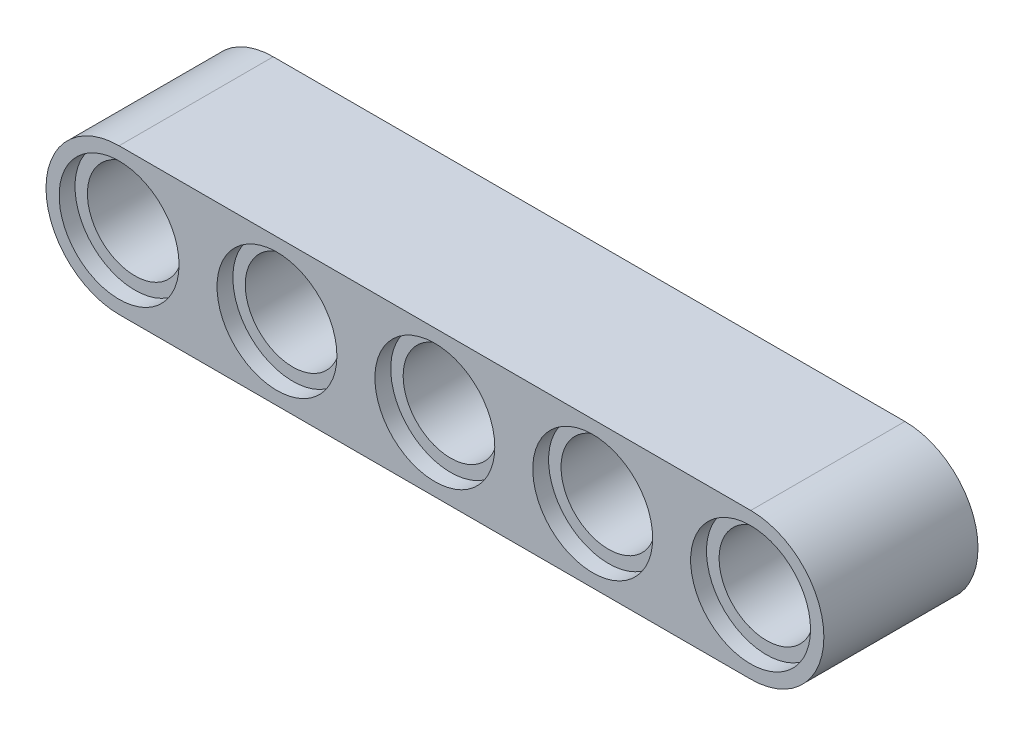
ISO-10303-21;
HEADER;
FILE_DESCRIPTION(('STEP AP214'),'2;1');
FILE_NAME('part.step','',(''),(''),'','','');
FILE_SCHEMA(('AUTOMOTIVE_DESIGN { 1 0 10303 214 1 1 1 1 }'));
ENDSEC;
DATA;
#1=APPLICATION_CONTEXT('core data for automotive mechanical design processes');
#2=APPLICATION_PROTOCOL_DEFINITION('international standard','automotive_design',2000,#1);
#3=PRODUCT_CONTEXT('',#1,'mechanical');
#4=PRODUCT('Part','Part','',(#3));
#5=PRODUCT_RELATED_PRODUCT_CATEGORY('part','',(#4));
#6=PRODUCT_DEFINITION_FORMATION('','',#4);
#7=PRODUCT_DEFINITION_CONTEXT('part definition',#1,'design');
#8=PRODUCT_DEFINITION('design','',#6,#7);
#9=PRODUCT_DEFINITION_SHAPE('','',#8);
#10=(LENGTH_UNIT() NAMED_UNIT(*) SI_UNIT(.MILLI.,.METRE.));
#11=(NAMED_UNIT(*) PLANE_ANGLE_UNIT() SI_UNIT($,.RADIAN.));
#12=(NAMED_UNIT(*) SI_UNIT($,.STERADIAN.) SOLID_ANGLE_UNIT());
#13=UNCERTAINTY_MEASURE_WITH_UNIT(LENGTH_MEASURE(1.E-05),#10,'distance_accuracy_value','');
#14=(GEOMETRIC_REPRESENTATION_CONTEXT(3) GLOBAL_UNCERTAINTY_ASSIGNED_CONTEXT((#13)) GLOBAL_UNIT_ASSIGNED_CONTEXT((#10,
#11,#12)) REPRESENTATION_CONTEXT('',''));
#15=CARTESIAN_POINT('',(0.,0.,0.));
#16=DIRECTION('',(0.,0.,1.));
#17=DIRECTION('',(1.,0.,0.));
#18=AXIS2_PLACEMENT_3D('',#15,#16,#17);
#19=CARTESIAN_POINT('',(-240.6,-24.8965545458983,-0.01));
#20=DIRECTION('',(0.,0.,1.));
#21=DIRECTION('',(1.,0.,0.));
#22=AXIS2_PLACEMENT_3D('',#19,#20,#21);
#23=CYLINDRICAL_SURFACE('',#22,24.);
#24=CARTESIAN_POINT('',(-240.6,-24.8965545458983,69.8));
#25=DIRECTION('',(0.,0.,1.));
#26=DIRECTION('',(1.,0.,0.));
#27=AXIS2_PLACEMENT_3D('',#24,#25,#26);
#28=CIRCLE('',#27,24.);
#29=CARTESIAN_POINT('',(-216.6,-24.8965545458983,69.8));
#30=VERTEX_POINT('',#29);
#31=EDGE_CURVE('E521',#30,#30,#28,.F.);
#32=ORIENTED_EDGE('',*,*,#31,.F.);
#33=EDGE_LOOP('',(#32));
#34=FACE_BOUND('',#33,.T.);
#35=CARTESIAN_POINT('',(-240.6,-24.8965545458983,7.99));
#36=DIRECTION('',(0.,0.,-1.));
#37=DIRECTION('',(-1.,0.,0.));
#38=AXIS2_PLACEMENT_3D('',#35,#36,#37);
#39=CIRCLE('',#38,24.);
#40=CARTESIAN_POINT('',(-264.6,-24.8965545458983,7.99));
#41=VERTEX_POINT('',#40);
#42=EDGE_CURVE('E463',#41,#41,#39,.F.);
#43=ORIENTED_EDGE('',*,*,#42,.F.);
#44=EDGE_LOOP('',(#43));
#45=FACE_BOUND('',#44,.T.);
#46=ADVANCED_FACE('F459',(#34,#45),#23,.F.);
#47=CARTESIAN_POINT('',(78.3,-24.8965545458983,77.8));
#48=DIRECTION('',(0.,0.,-1.));
#49=DIRECTION('',(-1.,0.,0.));
#50=AXIS2_PLACEMENT_3D('',#47,#48,#49);
#51=CYLINDRICAL_SURFACE('',#50,24.);
#52=CARTESIAN_POINT('',(78.3,-24.8965545458983,69.8));
#53=DIRECTION('',(0.,0.,1.));
#54=DIRECTION('',(1.,0.,0.));
#55=AXIS2_PLACEMENT_3D('',#52,#53,#54);
#56=CIRCLE('',#55,24.);
#57=CARTESIAN_POINT('',(102.3,-24.8965545458983,69.8));
#58=VERTEX_POINT('',#57);
#59=EDGE_CURVE('E524',#58,#58,#56,.T.);
#60=ORIENTED_EDGE('',*,*,#59,.T.);
#61=EDGE_LOOP('',(#60));
#62=FACE_BOUND('',#61,.T.);
#63=CARTESIAN_POINT('',(78.3,-24.8965545458983,7.99));
#64=DIRECTION('',(0.,0.,-1.));
#65=DIRECTION('',(-1.,0.,0.));
#66=AXIS2_PLACEMENT_3D('',#63,#64,#65);
#67=CIRCLE('',#66,24.);
#68=CARTESIAN_POINT('',(54.3,-24.8965545458983,7.99));
#69=VERTEX_POINT('',#68);
#70=EDGE_CURVE('E561',#69,#69,#67,.T.);
#71=ORIENTED_EDGE('',*,*,#70,.T.);
#72=EDGE_LOOP('',(#71));
#73=FACE_BOUND('',#72,.T.);
#74=ADVANCED_FACE('F663',(#62,#73),#51,.F.);
#75=CARTESIAN_POINT('',(-1.50000000000003,-24.8965545458983,77.8));
#76=DIRECTION('',(0.,0.,-1.));
#77=DIRECTION('',(-1.,0.,0.));
#78=AXIS2_PLACEMENT_3D('',#75,#76,#77);
#79=CYLINDRICAL_SURFACE('',#78,24.);
#80=CARTESIAN_POINT('',(-1.50000000000003,-24.8965545458983,69.8));
#81=DIRECTION('',(0.,0.,1.));
#82=DIRECTION('',(1.,0.,0.));
#83=AXIS2_PLACEMENT_3D('',#80,#81,#82);
#84=CIRCLE('',#83,24.);
#85=CARTESIAN_POINT('',(22.5,-24.8965545458983,69.8));
#86=VERTEX_POINT('',#85);
#87=EDGE_CURVE('E547',#86,#86,#84,.T.);
#88=ORIENTED_EDGE('',*,*,#87,.T.);
#89=EDGE_LOOP('',(#88));
#90=FACE_BOUND('',#89,.T.);
#91=CARTESIAN_POINT('',(-1.50000000000003,-24.8965545458983,7.99));
#92=DIRECTION('',(0.,0.,-1.));
#93=DIRECTION('',(-1.,0.,0.));
#94=AXIS2_PLACEMENT_3D('',#91,#92,#93);
#95=CIRCLE('',#94,24.);
#96=CARTESIAN_POINT('',(-25.5,-24.8965545458983,7.99));
#97=VERTEX_POINT('',#96);
#98=EDGE_CURVE('E559',#97,#97,#95,.T.);
#99=ORIENTED_EDGE('',*,*,#98,.T.);
#100=EDGE_LOOP('',(#99));
#101=FACE_BOUND('',#100,.T.);
#102=ADVANCED_FACE('F669',(#90,#101),#79,.F.);
#103=CARTESIAN_POINT('',(-81.2,-24.8965545458983,77.8));
#104=DIRECTION('',(0.,0.,-1.));
#105=DIRECTION('',(-1.,0.,0.));
#106=AXIS2_PLACEMENT_3D('',#103,#104,#105);
#107=CYLINDRICAL_SURFACE('',#106,24.);
#108=CARTESIAN_POINT('',(-81.2,-24.8965545458983,69.8));
#109=DIRECTION('',(0.,0.,1.));
#110=DIRECTION('',(1.,0.,0.));
#111=AXIS2_PLACEMENT_3D('',#108,#109,#110);
#112=CIRCLE('',#111,24.);
#113=CARTESIAN_POINT('',(-57.2,-24.8965545458983,69.8));
#114=VERTEX_POINT('',#113);
#115=EDGE_CURVE('E543',#114,#114,#112,.T.);
#116=ORIENTED_EDGE('',*,*,#115,.T.);
#117=EDGE_LOOP('',(#116));
#118=FACE_BOUND('',#117,.T.);
#119=CARTESIAN_POINT('',(-81.2,-24.8965545458983,7.99));
#120=DIRECTION('',(0.,0.,-1.));
#121=DIRECTION('',(-1.,0.,0.));
#122=AXIS2_PLACEMENT_3D('',#119,#120,#121);
#123=CIRCLE('',#122,24.);
#124=CARTESIAN_POINT('',(-105.2,-24.8965545458983,7.99));
#125=VERTEX_POINT('',#124);
#126=EDGE_CURVE('E555',#125,#125,#123,.T.);
#127=ORIENTED_EDGE('',*,*,#126,.T.);
#128=EDGE_LOOP('',(#127));
#129=FACE_BOUND('',#128,.T.);
#130=ADVANCED_FACE('F679',(#118,#129),#107,.F.);
#131=CARTESIAN_POINT('',(-160.9,-24.8965545458983,77.8));
#132=DIRECTION('',(0.,0.,-1.));
#133=DIRECTION('',(-1.,0.,0.));
#134=AXIS2_PLACEMENT_3D('',#131,#132,#133);
#135=CYLINDRICAL_SURFACE('',#134,24.);
#136=CARTESIAN_POINT('',(-160.9,-24.8965545458983,69.8));
#137=DIRECTION('',(0.,0.,1.));
#138=DIRECTION('',(1.,0.,0.));
#139=AXIS2_PLACEMENT_3D('',#136,#137,#138);
#140=CIRCLE('',#139,24.);
#141=CARTESIAN_POINT('',(-136.9,-24.8965545458983,69.8));
#142=VERTEX_POINT('',#141);
#143=EDGE_CURVE('E540',#142,#142,#140,.T.);
#144=ORIENTED_EDGE('',*,*,#143,.T.);
#145=EDGE_LOOP('',(#144));
#146=FACE_BOUND('',#145,.T.);
#147=CARTESIAN_POINT('',(-160.9,-24.8965545458983,7.99));
#148=DIRECTION('',(0.,0.,-1.));
#149=DIRECTION('',(-1.,0.,0.));
#150=AXIS2_PLACEMENT_3D('',#147,#148,#149);
#151=CIRCLE('',#150,24.);
#152=CARTESIAN_POINT('',(-184.9,-24.8965545458983,7.99));
#153=VERTEX_POINT('',#152);
#154=EDGE_CURVE('E552',#153,#153,#151,.T.);
#155=ORIENTED_EDGE('',*,*,#154,.T.);
#156=EDGE_LOOP('',(#155));
#157=FACE_BOUND('',#156,.T.);
#158=ADVANCED_FACE('F683',(#146,#157),#135,.F.);
#159=CARTESIAN_POINT('',(-240.6,-24.8965545458983,77.8));
#160=DIRECTION('',(0.,0.,1.));
#161=DIRECTION('',(1.,0.,0.));
#162=AXIS2_PLACEMENT_3D('',#159,#160,#161);
#163=PLANE('',#162);
#164=CARTESIAN_POINT('',(-240.6,-24.8965545458983,77.8));
#165=DIRECTION('',(0.,0.,1.));
#166=DIRECTION('',(1.,0.,0.));
#167=AXIS2_PLACEMENT_3D('',#164,#165,#166);
#168=CIRCLE('',#167,30.2630714703831);
#169=CARTESIAN_POINT('',(-210.336928529617,-24.8965545458983,77.8));
#170=VERTEX_POINT('',#169);
#171=EDGE_CURVE('E594',#170,#170,#168,.T.);
#172=ORIENTED_EDGE('',*,*,#171,.F.);
#173=EDGE_LOOP('',(#172));
#174=FACE_BOUND('',#173,.T.);
#175=CARTESIAN_POINT('',(-160.9,-24.8965545458983,77.8));
#176=DIRECTION('',(0.,0.,1.));
#177=DIRECTION('',(1.,0.,0.));
#178=AXIS2_PLACEMENT_3D('',#175,#176,#177);
#179=CIRCLE('',#178,30.2630714703831);
#180=CARTESIAN_POINT('',(-130.636928529617,-24.8965545458983,77.8));
#181=VERTEX_POINT('',#180);
#182=EDGE_CURVE('E591',#181,#181,#179,.T.);
#183=ORIENTED_EDGE('',*,*,#182,.F.);
#184=EDGE_LOOP('',(#183));
#185=FACE_BOUND('',#184,.T.);
#186=CARTESIAN_POINT('',(-81.2,-24.8965545458983,77.8));
#187=DIRECTION('',(0.,0.,1.));
#188=DIRECTION('',(1.,0.,0.));
#189=AXIS2_PLACEMENT_3D('',#186,#187,#188);
#190=CIRCLE('',#189,30.2630714703831);
#191=CARTESIAN_POINT('',(-50.9369285296169,-24.8965545458983,77.8));
#192=VERTEX_POINT('',#191);
#193=EDGE_CURVE('E585',#192,#192,#190,.T.);
#194=ORIENTED_EDGE('',*,*,#193,.F.);
#195=EDGE_LOOP('',(#194));
#196=FACE_BOUND('',#195,.T.);
#197=CARTESIAN_POINT('',(-1.50000000000003,-24.8965545458983,77.8));
#198=DIRECTION('',(0.,0.,1.));
#199=DIRECTION('',(1.,0.,0.));
#200=AXIS2_PLACEMENT_3D('',#197,#198,#199);
#201=CIRCLE('',#200,30.2630714703831);
#202=CARTESIAN_POINT('',(28.7630714703831,-24.8965545458983,77.8));
#203=VERTEX_POINT('',#202);
#204=EDGE_CURVE('E577',#203,#203,#201,.T.);
#205=ORIENTED_EDGE('',*,*,#204,.F.);
#206=EDGE_LOOP('',(#205));
#207=FACE_BOUND('',#206,.T.);
#208=CARTESIAN_POINT('',(78.2,-24.8965545458983,77.8));
#209=DIRECTION('',(0.,0.,1.));
#210=DIRECTION('',(1.,0.,0.));
#211=AXIS2_PLACEMENT_3D('',#208,#209,#210);
#212=CIRCLE('',#211,30.2630714703831);
#213=CARTESIAN_POINT('',(108.463071470383,-24.8965545458983,77.8));
#214=VERTEX_POINT('',#213);
#215=EDGE_CURVE('E569',#214,#214,#212,.T.);
#216=ORIENTED_EDGE('',*,*,#215,.F.);
#217=EDGE_LOOP('',(#216));
#218=FACE_BOUND('',#217,.T.);
#219=DIRECTION('',(1.,0.,0.));
#220=VECTOR('',#219,1.);
#221=CARTESIAN_POINT('',(0.,-61.7965545458983,77.8));
#222=LINE('',#221,#220);
#223=CARTESIAN_POINT('',(-240.6,-61.7965545458983,77.8));
#224=VERTEX_POINT('',#223);
#225=CARTESIAN_POINT('',(78.3,-61.7965545458983,77.8));
#226=VERTEX_POINT('',#225);
#227=EDGE_CURVE('E501',#224,#226,#222,.T.);
#228=ORIENTED_EDGE('',*,*,#227,.T.);
#229=CARTESIAN_POINT('',(78.3,-24.8965545458983,77.8));
#230=DIRECTION('',(0.,0.,1.));
#231=DIRECTION('',(1.,0.,0.));
#232=AXIS2_PLACEMENT_3D('',#229,#230,#231);
#233=CIRCLE('',#232,36.9);
#234=CARTESIAN_POINT('',(78.3,12.0034454541017,77.8));
#235=VERTEX_POINT('',#234);
#236=EDGE_CURVE('E510',#226,#235,#233,.T.);
#237=ORIENTED_EDGE('',*,*,#236,.T.);
#238=DIRECTION('',(1.,0.,0.));
#239=VECTOR('',#238,1.);
#240=CARTESIAN_POINT('',(0.,12.0034454541017,77.8));
#241=LINE('',#240,#239);
#242=CARTESIAN_POINT('',(-240.6,12.0034454541017,77.8));
#243=VERTEX_POINT('',#242);
#244=EDGE_CURVE('E516',#243,#235,#241,.T.);
#245=ORIENTED_EDGE('',*,*,#244,.F.);
#246=CARTESIAN_POINT('',(-240.6,-24.8965545458983,77.8));
#247=DIRECTION('',(0.,0.,1.));
#248=DIRECTION('',(1.,0.,0.));
#249=AXIS2_PLACEMENT_3D('',#246,#247,#248);
#250=CIRCLE('',#249,36.9);
#251=EDGE_CURVE('E520',#243,#224,#250,.T.);
#252=ORIENTED_EDGE('',*,*,#251,.T.);
#253=EDGE_LOOP('',(#228,#237,#245,#252));
#254=FACE_BOUND('',#253,.T.);
#255=ADVANCED_FACE('F519',(#174,#185,#196,#207,#218,#254),#163,.T.);
#256=CARTESIAN_POINT('',(-240.6,-24.8965545458983,-0.01));
#257=DIRECTION('',(0.,0.,1.));
#258=DIRECTION('',(1.,0.,0.));
#259=AXIS2_PLACEMENT_3D('',#256,#257,#258);
#260=PLANE('',#259);
#261=CARTESIAN_POINT('',(78.3,-24.8965545458983,-0.01));
#262=DIRECTION('',(0.,0.,-1.));
#263=DIRECTION('',(-1.,0.,0.));
#264=AXIS2_PLACEMENT_3D('',#261,#262,#263);
#265=CIRCLE('',#264,30.265);
#266=CARTESIAN_POINT('',(48.035,-24.8965545458983,-0.01));
#267=VERTEX_POINT('',#266);
#268=EDGE_CURVE('E623',#267,#267,#265,.T.);
#269=ORIENTED_EDGE('',*,*,#268,.F.);
#270=EDGE_LOOP('',(#269));
#271=FACE_BOUND('',#270,.T.);
#272=CARTESIAN_POINT('',(-1.39999999999998,-24.8965545458983,-0.01));
#273=DIRECTION('',(0.,0.,-1.));
#274=DIRECTION('',(-1.,0.,0.));
#275=AXIS2_PLACEMENT_3D('',#272,#273,#274);
#276=CIRCLE('',#275,30.265);
#277=CARTESIAN_POINT('',(-31.665,-24.8965545458983,-0.01));
#278=VERTEX_POINT('',#277);
#279=EDGE_CURVE('E620',#278,#278,#276,.T.);
#280=ORIENTED_EDGE('',*,*,#279,.F.);
#281=EDGE_LOOP('',(#280));
#282=FACE_BOUND('',#281,.T.);
#283=CARTESIAN_POINT('',(-81.1,-24.8965545458983,-0.01));
#284=DIRECTION('',(0.,0.,-1.));
#285=DIRECTION('',(-1.,0.,0.));
#286=AXIS2_PLACEMENT_3D('',#283,#284,#285);
#287=CIRCLE('',#286,30.265);
#288=CARTESIAN_POINT('',(-111.365,-24.8965545458983,-0.01));
#289=VERTEX_POINT('',#288);
#290=EDGE_CURVE('E614',#289,#289,#287,.T.);
#291=ORIENTED_EDGE('',*,*,#290,.F.);
#292=EDGE_LOOP('',(#291));
#293=FACE_BOUND('',#292,.T.);
#294=CARTESIAN_POINT('',(-160.8,-24.8965545458983,-0.01));
#295=DIRECTION('',(0.,0.,-1.));
#296=DIRECTION('',(-1.,0.,0.));
#297=AXIS2_PLACEMENT_3D('',#294,#295,#296);
#298=CIRCLE('',#297,30.265);
#299=CARTESIAN_POINT('',(-191.065,-24.8965545458983,-0.01));
#300=VERTEX_POINT('',#299);
#301=EDGE_CURVE('E608',#300,#300,#298,.T.);
#302=ORIENTED_EDGE('',*,*,#301,.F.);
#303=EDGE_LOOP('',(#302));
#304=FACE_BOUND('',#303,.T.);
#305=CARTESIAN_POINT('',(-240.5,-24.8965545458983,-0.01));
#306=DIRECTION('',(0.,0.,-1.));
#307=DIRECTION('',(-1.,0.,0.));
#308=AXIS2_PLACEMENT_3D('',#305,#306,#307);
#309=CIRCLE('',#308,30.265);
#310=CARTESIAN_POINT('',(-270.765,-24.8965545458983,-0.01));
#311=VERTEX_POINT('',#310);
#312=EDGE_CURVE('E602',#311,#311,#309,.T.);
#313=ORIENTED_EDGE('',*,*,#312,.F.);
#314=EDGE_LOOP('',(#313));
#315=FACE_BOUND('',#314,.T.);
#316=DIRECTION('',(1.,0.,0.));
#317=VECTOR('',#316,1.);
#318=CARTESIAN_POINT('',(0.,-61.7965545458983,-0.01));
#319=LINE('',#318,#317);
#320=CARTESIAN_POINT('',(-240.6,-61.7965545458983,-0.01));
#321=VERTEX_POINT('',#320);
#322=CARTESIAN_POINT('',(78.3,-61.7965545458983,-0.01));
#323=VERTEX_POINT('',#322);
#324=EDGE_CURVE('E502',#321,#323,#319,.T.);
#325=ORIENTED_EDGE('',*,*,#324,.F.);
#326=CARTESIAN_POINT('',(-240.6,-24.8965545458983,-0.01));
#327=DIRECTION('',(0.,0.,1.));
#328=DIRECTION('',(1.,0.,0.));
#329=AXIS2_PLACEMENT_3D('',#326,#327,#328);
#330=CIRCLE('',#329,36.9);
#331=CARTESIAN_POINT('',(-240.6,12.0034454541017,-0.01));
#332=VERTEX_POINT('',#331);
#333=EDGE_CURVE('E507',#332,#321,#330,.T.);
#334=ORIENTED_EDGE('',*,*,#333,.F.);
#335=DIRECTION('',(1.,0.,0.));
#336=VECTOR('',#335,1.);
#337=CARTESIAN_POINT('',(0.,12.0034454541017,-0.01));
#338=LINE('',#337,#336);
#339=CARTESIAN_POINT('',(78.3,12.0034454541017,-0.01));
#340=VERTEX_POINT('',#339);
#341=EDGE_CURVE('E535',#332,#340,#338,.T.);
#342=ORIENTED_EDGE('',*,*,#341,.T.);
#343=CARTESIAN_POINT('',(78.3,-24.8965545458983,-0.01));
#344=DIRECTION('',(0.,0.,1.));
#345=DIRECTION('',(1.,0.,0.));
#346=AXIS2_PLACEMENT_3D('',#343,#344,#345);
#347=CIRCLE('',#346,36.9);
#348=EDGE_CURVE('E533',#323,#340,#347,.T.);
#349=ORIENTED_EDGE('',*,*,#348,.F.);
#350=EDGE_LOOP('',(#325,#334,#342,#349));
#351=FACE_BOUND('',#350,.T.);
#352=ADVANCED_FACE('F638',(#271,#282,#293,#304,#315,#351),#260,.F.);
#353=CARTESIAN_POINT('',(-240.6,-24.8965545458983,-0.01));
#354=DIRECTION('',(0.,0.,1.));
#355=DIRECTION('',(1.,0.,0.));
#356=AXIS2_PLACEMENT_3D('',#353,#354,#355);
#357=CYLINDRICAL_SURFACE('',#356,36.9);
#358=DIRECTION('',(0.,0.,1.));
#359=VECTOR('',#358,1.);
#360=CARTESIAN_POINT('',(-240.6,-61.7965545458983,-0.01));
#361=LINE('',#360,#359);
#362=EDGE_CURVE('E12',#321,#224,#361,.T.);
#363=ORIENTED_EDGE('',*,*,#362,.T.);
#364=ORIENTED_EDGE('',*,*,#251,.F.);
#365=DIRECTION('',(0.,0.,1.));
#366=VECTOR('',#365,1.);
#367=CARTESIAN_POINT('',(-240.6,12.0034454541017,-0.01));
#368=LINE('',#367,#366);
#369=EDGE_CURVE('E468',#332,#243,#368,.T.);
#370=ORIENTED_EDGE('',*,*,#369,.F.);
#371=ORIENTED_EDGE('',*,*,#333,.T.);
#372=EDGE_LOOP('',(#363,#364,#370,#371));
#373=FACE_BOUND('',#372,.T.);
#374=ADVANCED_FACE('F641',(#373),#357,.T.);
#375=CARTESIAN_POINT('',(0.,12.0034454541017,-0.01));
#376=DIRECTION('',(0.,-1.,0.));
#377=DIRECTION('',(0.,0.,-1.));
#378=AXIS2_PLACEMENT_3D('',#375,#376,#377);
#379=PLANE('',#378);
#380=ORIENTED_EDGE('',*,*,#369,.T.);
#381=ORIENTED_EDGE('',*,*,#244,.T.);
#382=DIRECTION('',(0.,0.,1.));
#383=VECTOR('',#382,1.);
#384=CARTESIAN_POINT('',(78.3,12.0034454541017,-0.01));
#385=LINE('',#384,#383);
#386=EDGE_CURVE('E506',#340,#235,#385,.T.);
#387=ORIENTED_EDGE('',*,*,#386,.F.);
#388=ORIENTED_EDGE('',*,*,#341,.F.);
#389=EDGE_LOOP('',(#380,#381,#387,#388));
#390=FACE_BOUND('',#389,.T.);
#391=ADVANCED_FACE('F653',(#390),#379,.F.);
#392=CARTESIAN_POINT('',(78.3,-24.8965545458983,-0.01));
#393=DIRECTION('',(0.,0.,1.));
#394=DIRECTION('',(1.,0.,0.));
#395=AXIS2_PLACEMENT_3D('',#392,#393,#394);
#396=CYLINDRICAL_SURFACE('',#395,36.9);
#397=ORIENTED_EDGE('',*,*,#386,.T.);
#398=ORIENTED_EDGE('',*,*,#236,.F.);
#399=DIRECTION('',(0.,0.,1.));
#400=VECTOR('',#399,1.);
#401=CARTESIAN_POINT('',(78.3,-61.7965545458983,-0.01));
#402=LINE('',#401,#400);
#403=EDGE_CURVE('E498',#323,#226,#402,.T.);
#404=ORIENTED_EDGE('',*,*,#403,.F.);
#405=ORIENTED_EDGE('',*,*,#348,.T.);
#406=EDGE_LOOP('',(#397,#398,#404,#405));
#407=FACE_BOUND('',#406,.T.);
#408=ADVANCED_FACE('F511',(#407),#396,.T.);
#409=CARTESIAN_POINT('',(0.,-61.7965545458983,-0.01));
#410=DIRECTION('',(0.,-1.,0.));
#411=DIRECTION('',(0.,0.,-1.));
#412=AXIS2_PLACEMENT_3D('',#409,#410,#411);
#413=PLANE('',#412);
#414=ORIENTED_EDGE('',*,*,#403,.T.);
#415=ORIENTED_EDGE('',*,*,#227,.F.);
#416=ORIENTED_EDGE('',*,*,#362,.F.);
#417=ORIENTED_EDGE('',*,*,#324,.T.);
#418=EDGE_LOOP('',(#414,#415,#416,#417));
#419=FACE_BOUND('',#418,.T.);
#420=ADVANCED_FACE('F461',(#419),#413,.T.);
#421=CARTESIAN_POINT('',(-160.9,-24.8965545458983,69.8));
#422=DIRECTION('',(0.,0.,1.));
#423=DIRECTION('',(1.,0.,0.));
#424=AXIS2_PLACEMENT_3D('',#421,#422,#423);
#425=CYLINDRICAL_SURFACE('',#424,30.2630714703831);
#426=CARTESIAN_POINT('',(-160.9,-24.8965545458983,69.8));
#427=DIRECTION('',(0.,0.,1.));
#428=DIRECTION('',(1.,0.,0.));
#429=AXIS2_PLACEMENT_3D('',#426,#427,#428);
#430=CIRCLE('',#429,30.2630714703831);
#431=CARTESIAN_POINT('',(-130.636928529617,-24.8965545458983,69.8));
#432=VERTEX_POINT('',#431);
#433=EDGE_CURVE('E588',#432,#432,#430,.T.);
#434=ORIENTED_EDGE('',*,*,#433,.F.);
#435=EDGE_LOOP('',(#434));
#436=FACE_BOUND('',#435,.T.);
#437=ORIENTED_EDGE('',*,*,#182,.T.);
#438=EDGE_LOOP('',(#437));
#439=FACE_BOUND('',#438,.T.);
#440=ADVANCED_FACE('F660',(#436,#439),#425,.F.);
#441=CARTESIAN_POINT('',(-160.9,-24.8965545458983,69.8));
#442=DIRECTION('',(0.,0.,1.));
#443=DIRECTION('',(1.,0.,0.));
#444=AXIS2_PLACEMENT_3D('',#441,#442,#443);
#445=PLANE('',#444);
#446=ORIENTED_EDGE('',*,*,#143,.F.);
#447=EDGE_LOOP('',(#446));
#448=FACE_BOUND('',#447,.T.);
#449=ORIENTED_EDGE('',*,*,#433,.T.);
#450=EDGE_LOOP('',(#449));
#451=FACE_BOUND('',#450,.T.);
#452=ADVANCED_FACE('F731',(#448,#451),#445,.T.);
#453=CARTESIAN_POINT('',(-81.2,-24.8965545458983,69.8));
#454=DIRECTION('',(0.,0.,1.));
#455=DIRECTION('',(1.,0.,0.));
#456=AXIS2_PLACEMENT_3D('',#453,#454,#455);
#457=CYLINDRICAL_SURFACE('',#456,30.2630714703831);
#458=CARTESIAN_POINT('',(-81.2,-24.8965545458983,69.8));
#459=DIRECTION('',(0.,0.,1.));
#460=DIRECTION('',(1.,0.,0.));
#461=AXIS2_PLACEMENT_3D('',#458,#459,#460);
#462=CIRCLE('',#461,30.2630714703831);
#463=CARTESIAN_POINT('',(-50.9369285296169,-24.8965545458983,69.8));
#464=VERTEX_POINT('',#463);
#465=EDGE_CURVE('E582',#464,#464,#462,.T.);
#466=ORIENTED_EDGE('',*,*,#465,.F.);
#467=EDGE_LOOP('',(#466));
#468=FACE_BOUND('',#467,.T.);
#469=ORIENTED_EDGE('',*,*,#193,.T.);
#470=EDGE_LOOP('',(#469));
#471=FACE_BOUND('',#470,.T.);
#472=ADVANCED_FACE('F735',(#468,#471),#457,.F.);
#473=CARTESIAN_POINT('',(-81.2,-24.8965545458983,69.8));
#474=DIRECTION('',(0.,0.,1.));
#475=DIRECTION('',(1.,0.,0.));
#476=AXIS2_PLACEMENT_3D('',#473,#474,#475);
#477=PLANE('',#476);
#478=ORIENTED_EDGE('',*,*,#115,.F.);
#479=EDGE_LOOP('',(#478));
#480=FACE_BOUND('',#479,.T.);
#481=ORIENTED_EDGE('',*,*,#465,.T.);
#482=EDGE_LOOP('',(#481));
#483=FACE_BOUND('',#482,.T.);
#484=ADVANCED_FACE('F739',(#480,#483),#477,.T.);
#485=CARTESIAN_POINT('',(-1.50000000000003,-24.8965545458983,69.8));
#486=DIRECTION('',(0.,0.,1.));
#487=DIRECTION('',(1.,0.,0.));
#488=AXIS2_PLACEMENT_3D('',#485,#486,#487);
#489=CYLINDRICAL_SURFACE('',#488,30.2630714703831);
#490=CARTESIAN_POINT('',(-1.50000000000003,-24.8965545458983,69.8));
#491=DIRECTION('',(0.,0.,1.));
#492=DIRECTION('',(1.,0.,0.));
#493=AXIS2_PLACEMENT_3D('',#490,#491,#492);
#494=CIRCLE('',#493,30.2630714703831);
#495=CARTESIAN_POINT('',(28.7630714703831,-24.8965545458983,69.8));
#496=VERTEX_POINT('',#495);
#497=EDGE_CURVE('E573',#496,#496,#494,.T.);
#498=ORIENTED_EDGE('',*,*,#497,.F.);
#499=EDGE_LOOP('',(#498));
#500=FACE_BOUND('',#499,.T.);
#501=ORIENTED_EDGE('',*,*,#204,.T.);
#502=EDGE_LOOP('',(#501));
#503=FACE_BOUND('',#502,.T.);
#504=ADVANCED_FACE('F743',(#500,#503),#489,.F.);
#505=CARTESIAN_POINT('',(-1.50000000000003,-24.8965545458983,69.8));
#506=DIRECTION('',(0.,0.,1.));
#507=DIRECTION('',(1.,0.,0.));
#508=AXIS2_PLACEMENT_3D('',#505,#506,#507);
#509=PLANE('',#508);
#510=ORIENTED_EDGE('',*,*,#87,.F.);
#511=EDGE_LOOP('',(#510));
#512=FACE_BOUND('',#511,.T.);
#513=ORIENTED_EDGE('',*,*,#497,.T.);
#514=EDGE_LOOP('',(#513));
#515=FACE_BOUND('',#514,.T.);
#516=ADVANCED_FACE('F747',(#512,#515),#509,.T.);
#517=CARTESIAN_POINT('',(78.2,-24.8965545458983,69.8));
#518=DIRECTION('',(0.,0.,1.));
#519=DIRECTION('',(1.,0.,0.));
#520=AXIS2_PLACEMENT_3D('',#517,#518,#519);
#521=CYLINDRICAL_SURFACE('',#520,30.2630714703831);
#522=CARTESIAN_POINT('',(78.2,-24.8965545458983,69.8));
#523=DIRECTION('',(0.,0.,1.));
#524=DIRECTION('',(1.,0.,0.));
#525=AXIS2_PLACEMENT_3D('',#522,#523,#524);
#526=CIRCLE('',#525,30.2630714703831);
#527=CARTESIAN_POINT('',(108.463071470383,-24.8965545458983,69.8));
#528=VERTEX_POINT('',#527);
#529=EDGE_CURVE('E527',#528,#528,#526,.T.);
#530=ORIENTED_EDGE('',*,*,#529,.F.);
#531=EDGE_LOOP('',(#530));
#532=FACE_BOUND('',#531,.T.);
#533=ORIENTED_EDGE('',*,*,#215,.T.);
#534=EDGE_LOOP('',(#533));
#535=FACE_BOUND('',#534,.T.);
#536=ADVANCED_FACE('F751',(#532,#535),#521,.F.);
#537=CARTESIAN_POINT('',(78.2,-24.8965545458983,69.8));
#538=DIRECTION('',(0.,0.,1.));
#539=DIRECTION('',(1.,0.,0.));
#540=AXIS2_PLACEMENT_3D('',#537,#538,#539);
#541=PLANE('',#540);
#542=ORIENTED_EDGE('',*,*,#59,.F.);
#543=EDGE_LOOP('',(#542));
#544=FACE_BOUND('',#543,.T.);
#545=ORIENTED_EDGE('',*,*,#529,.T.);
#546=EDGE_LOOP('',(#545));
#547=FACE_BOUND('',#546,.T.);
#548=ADVANCED_FACE('F724',(#544,#547),#541,.T.);
#549=CARTESIAN_POINT('',(-240.6,-24.8965545458983,69.8));
#550=DIRECTION('',(0.,0.,1.));
#551=DIRECTION('',(1.,0.,0.));
#552=AXIS2_PLACEMENT_3D('',#549,#550,#551);
#553=PLANE('',#552);
#554=CARTESIAN_POINT('',(-240.6,-24.8965545458983,69.8));
#555=DIRECTION('',(0.,0.,1.));
#556=DIRECTION('',(1.,0.,0.));
#557=AXIS2_PLACEMENT_3D('',#554,#555,#556);
#558=CIRCLE('',#557,30.2630714703831);
#559=CARTESIAN_POINT('',(-210.336928529617,-24.8965545458983,69.8));
#560=VERTEX_POINT('',#559);
#561=EDGE_CURVE('E544',#560,#560,#558,.T.);
#562=ORIENTED_EDGE('',*,*,#561,.T.);
#563=EDGE_LOOP('',(#562));
#564=FACE_BOUND('',#563,.T.);
#565=ORIENTED_EDGE('',*,*,#31,.T.);
#566=EDGE_LOOP('',(#565));
#567=FACE_BOUND('',#566,.T.);
#568=ADVANCED_FACE('F721',(#564,#567),#553,.T.);
#569=CARTESIAN_POINT('',(-240.6,-24.8965545458983,69.8));
#570=DIRECTION('',(0.,0.,1.));
#571=DIRECTION('',(1.,0.,0.));
#572=AXIS2_PLACEMENT_3D('',#569,#570,#571);
#573=CYLINDRICAL_SURFACE('',#572,30.2630714703831);
#574=ORIENTED_EDGE('',*,*,#561,.F.);
#575=EDGE_LOOP('',(#574));
#576=FACE_BOUND('',#575,.T.);
#577=ORIENTED_EDGE('',*,*,#171,.T.);
#578=EDGE_LOOP('',(#577));
#579=FACE_BOUND('',#578,.T.);
#580=ADVANCED_FACE('F719',(#576,#579),#573,.F.);
#581=CARTESIAN_POINT('',(-240.5,-24.8965545458983,7.99));
#582=DIRECTION('',(0.,0.,-1.));
#583=DIRECTION('',(-1.,0.,0.));
#584=AXIS2_PLACEMENT_3D('',#581,#582,#583);
#585=PLANE('',#584);
#586=CARTESIAN_POINT('',(-240.5,-24.8965545458983,7.99));
#587=DIRECTION('',(0.,0.,-1.));
#588=DIRECTION('',(-1.,0.,0.));
#589=AXIS2_PLACEMENT_3D('',#586,#587,#588);
#590=CIRCLE('',#589,30.265);
#591=CARTESIAN_POINT('',(-270.765,-24.8965545458983,7.99));
#592=VERTEX_POINT('',#591);
#593=EDGE_CURVE('E599',#592,#592,#590,.T.);
#594=ORIENTED_EDGE('',*,*,#593,.T.);
#595=EDGE_LOOP('',(#594));
#596=FACE_BOUND('',#595,.T.);
#597=ORIENTED_EDGE('',*,*,#42,.T.);
#598=EDGE_LOOP('',(#597));
#599=FACE_BOUND('',#598,.T.);
#600=ADVANCED_FACE('F710',(#596,#599),#585,.T.);
#601=CARTESIAN_POINT('',(-240.5,-24.8965545458983,7.99));
#602=DIRECTION('',(0.,0.,-1.));
#603=DIRECTION('',(-1.,0.,0.));
#604=AXIS2_PLACEMENT_3D('',#601,#602,#603);
#605=CYLINDRICAL_SURFACE('',#604,30.265);
#606=ORIENTED_EDGE('',*,*,#593,.F.);
#607=EDGE_LOOP('',(#606));
#608=FACE_BOUND('',#607,.T.);
#609=ORIENTED_EDGE('',*,*,#312,.T.);
#610=EDGE_LOOP('',(#609));
#611=FACE_BOUND('',#610,.T.);
#612=ADVANCED_FACE('F705',(#608,#611),#605,.F.);
#613=CARTESIAN_POINT('',(-160.8,-24.8965545458983,7.99));
#614=DIRECTION('',(0.,0.,-1.));
#615=DIRECTION('',(-1.,0.,0.));
#616=AXIS2_PLACEMENT_3D('',#613,#614,#615);
#617=CYLINDRICAL_SURFACE('',#616,30.265);
#618=CARTESIAN_POINT('',(-160.8,-24.8965545458983,7.99));
#619=DIRECTION('',(0.,0.,-1.));
#620=DIRECTION('',(-1.,0.,0.));
#621=AXIS2_PLACEMENT_3D('',#618,#619,#620);
#622=CIRCLE('',#621,30.265);
#623=CARTESIAN_POINT('',(-191.065,-24.8965545458983,7.99));
#624=VERTEX_POINT('',#623);
#625=EDGE_CURVE('E605',#624,#624,#622,.T.);
#626=ORIENTED_EDGE('',*,*,#625,.F.);
#627=EDGE_LOOP('',(#626));
#628=FACE_BOUND('',#627,.T.);
#629=ORIENTED_EDGE('',*,*,#301,.T.);
#630=EDGE_LOOP('',(#629));
#631=FACE_BOUND('',#630,.T.);
#632=ADVANCED_FACE('F699',(#628,#631),#617,.F.);
#633=CARTESIAN_POINT('',(-160.8,-24.8965545458983,7.99));
#634=DIRECTION('',(0.,0.,-1.));
#635=DIRECTION('',(-1.,0.,0.));
#636=AXIS2_PLACEMENT_3D('',#633,#634,#635);
#637=PLANE('',#636);
#638=ORIENTED_EDGE('',*,*,#154,.F.);
#639=EDGE_LOOP('',(#638));
#640=FACE_BOUND('',#639,.T.);
#641=ORIENTED_EDGE('',*,*,#625,.T.);
#642=EDGE_LOOP('',(#641));
#643=FACE_BOUND('',#642,.T.);
#644=ADVANCED_FACE('F695',(#640,#643),#637,.T.);
#645=CARTESIAN_POINT('',(-81.1,-24.8965545458983,7.99));
#646=DIRECTION('',(0.,0.,-1.));
#647=DIRECTION('',(-1.,0.,0.));
#648=AXIS2_PLACEMENT_3D('',#645,#646,#647);
#649=CYLINDRICAL_SURFACE('',#648,30.265);
#650=CARTESIAN_POINT('',(-81.1,-24.8965545458983,7.99));
#651=DIRECTION('',(0.,0.,-1.));
#652=DIRECTION('',(-1.,0.,0.));
#653=AXIS2_PLACEMENT_3D('',#650,#651,#652);
#654=CIRCLE('',#653,30.265);
#655=CARTESIAN_POINT('',(-111.365,-24.8965545458983,7.99));
#656=VERTEX_POINT('',#655);
#657=EDGE_CURVE('E611',#656,#656,#654,.T.);
#658=ORIENTED_EDGE('',*,*,#657,.F.);
#659=EDGE_LOOP('',(#658));
#660=FACE_BOUND('',#659,.T.);
#661=ORIENTED_EDGE('',*,*,#290,.T.);
#662=EDGE_LOOP('',(#661));
#663=FACE_BOUND('',#662,.T.);
#664=ADVANCED_FACE('F698',(#660,#663),#649,.F.);
#665=CARTESIAN_POINT('',(-81.1,-24.8965545458983,7.99));
#666=DIRECTION('',(0.,0.,-1.));
#667=DIRECTION('',(-1.,0.,0.));
#668=AXIS2_PLACEMENT_3D('',#665,#666,#667);
#669=PLANE('',#668);
#670=ORIENTED_EDGE('',*,*,#126,.F.);
#671=EDGE_LOOP('',(#670));
#672=FACE_BOUND('',#671,.T.);
#673=ORIENTED_EDGE('',*,*,#657,.T.);
#674=EDGE_LOOP('',(#673));
#675=FACE_BOUND('',#674,.T.);
#676=ADVANCED_FACE('F714',(#672,#675),#669,.T.);
#677=CARTESIAN_POINT('',(-1.39999999999998,-24.8965545458983,7.99));
#678=DIRECTION('',(0.,0.,-1.));
#679=DIRECTION('',(-1.,0.,0.));
#680=AXIS2_PLACEMENT_3D('',#677,#678,#679);
#681=CYLINDRICAL_SURFACE('',#680,30.265);
#682=CARTESIAN_POINT('',(-1.39999999999998,-24.8965545458983,7.99));
#683=DIRECTION('',(0.,0.,-1.));
#684=DIRECTION('',(-1.,0.,0.));
#685=AXIS2_PLACEMENT_3D('',#682,#683,#684);
#686=CIRCLE('',#685,30.265);
#687=CARTESIAN_POINT('',(-31.665,-24.8965545458983,7.99));
#688=VERTEX_POINT('',#687);
#689=EDGE_CURVE('E617',#688,#688,#686,.T.);
#690=ORIENTED_EDGE('',*,*,#689,.F.);
#691=EDGE_LOOP('',(#690));
#692=FACE_BOUND('',#691,.T.);
#693=ORIENTED_EDGE('',*,*,#279,.T.);
#694=EDGE_LOOP('',(#693));
#695=FACE_BOUND('',#694,.T.);
#696=ADVANCED_FACE('F810',(#692,#695),#681,.F.);
#697=CARTESIAN_POINT('',(-1.39999999999998,-24.8965545458983,7.99));
#698=DIRECTION('',(0.,0.,-1.));
#699=DIRECTION('',(-1.,0.,0.));
#700=AXIS2_PLACEMENT_3D('',#697,#698,#699);
#701=PLANE('',#700);
#702=ORIENTED_EDGE('',*,*,#98,.F.);
#703=EDGE_LOOP('',(#702));
#704=FACE_BOUND('',#703,.T.);
#705=ORIENTED_EDGE('',*,*,#689,.T.);
#706=EDGE_LOOP('',(#705));
#707=FACE_BOUND('',#706,.T.);
#708=ADVANCED_FACE('F634',(#704,#707),#701,.T.);
#709=CARTESIAN_POINT('',(78.3,-24.8965545458983,7.99));
#710=DIRECTION('',(0.,0.,-1.));
#711=DIRECTION('',(-1.,0.,0.));
#712=AXIS2_PLACEMENT_3D('',#709,#710,#711);
#713=CYLINDRICAL_SURFACE('',#712,30.265);
#714=CARTESIAN_POINT('',(78.3,-24.8965545458983,7.99));
#715=DIRECTION('',(0.,0.,-1.));
#716=DIRECTION('',(-1.,0.,0.));
#717=AXIS2_PLACEMENT_3D('',#714,#715,#716);
#718=CIRCLE('',#717,30.265);
#719=CARTESIAN_POINT('',(48.035,-24.8965545458983,7.99));
#720=VERTEX_POINT('',#719);
#721=EDGE_CURVE('E556',#720,#720,#718,.T.);
#722=ORIENTED_EDGE('',*,*,#721,.F.);
#723=EDGE_LOOP('',(#722));
#724=FACE_BOUND('',#723,.T.);
#725=ORIENTED_EDGE('',*,*,#268,.T.);
#726=EDGE_LOOP('',(#725));
#727=FACE_BOUND('',#726,.T.);
#728=ADVANCED_FACE('F631',(#724,#727),#713,.F.);
#729=CARTESIAN_POINT('',(78.3,-24.8965545458983,7.99));
#730=DIRECTION('',(0.,0.,-1.));
#731=DIRECTION('',(-1.,0.,0.));
#732=AXIS2_PLACEMENT_3D('',#729,#730,#731);
#733=PLANE('',#732);
#734=ORIENTED_EDGE('',*,*,#70,.F.);
#735=EDGE_LOOP('',(#734));
#736=FACE_BOUND('',#735,.T.);
#737=ORIENTED_EDGE('',*,*,#721,.T.);
#738=EDGE_LOOP('',(#737));
#739=FACE_BOUND('',#738,.T.);
#740=ADVANCED_FACE('F629',(#736,#739),#733,.T.);
#741=CLOSED_SHELL('',(#46,#74,#102,#130,#158,#255,#352,#374,#391,#408,#420,#440,#452,#472,#484,
#504,#516,#536,#548,#568,#580,#600,#612,#632,#644,#664,#676,#696,#708,#728,#740));
#742=MANIFOLD_SOLID_BREP('B2',#741);
#743=ADVANCED_BREP_SHAPE_REPRESENTATION('',(#18,#742),#14);
#744=SHAPE_DEFINITION_REPRESENTATION(#9,#743);
ENDSEC;
END-ISO-10303-21;
